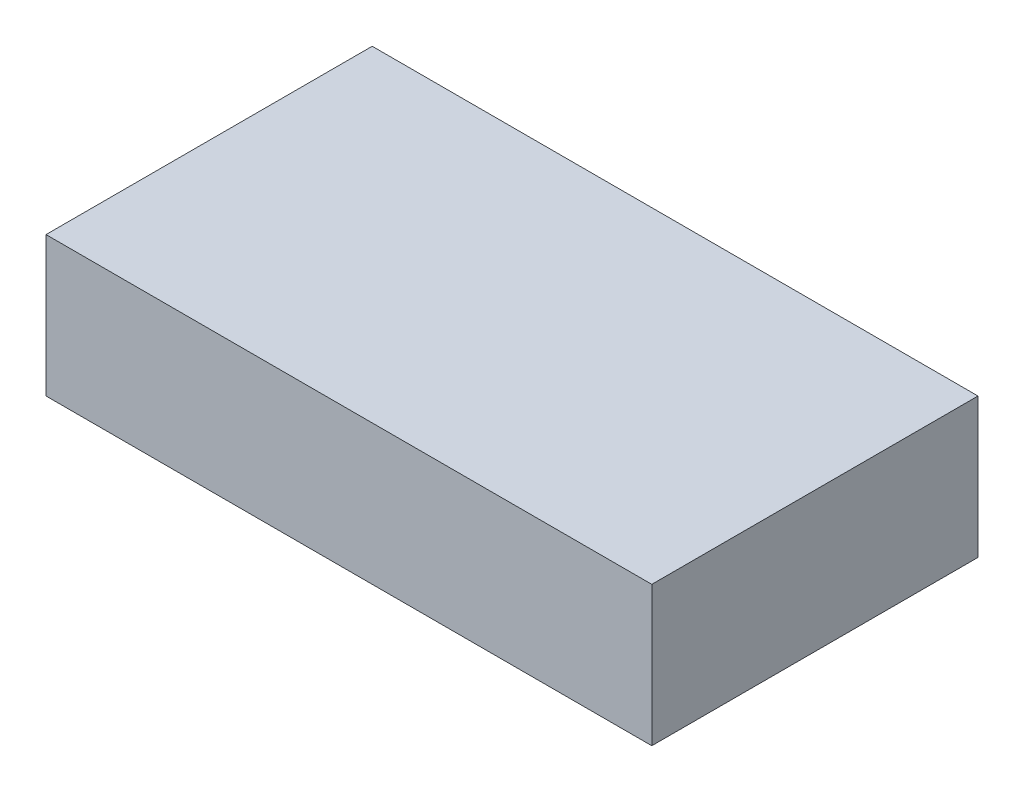
ISO-10303-21;
HEADER;
FILE_DESCRIPTION(('STEP AP214'),'2;1');
FILE_NAME('part.step','',(''),(''),'','','');
FILE_SCHEMA(('AUTOMOTIVE_DESIGN { 1 0 10303 214 1 1 1 1 }'));
ENDSEC;
DATA;
#1=APPLICATION_CONTEXT('core data for automotive mechanical design processes');
#2=APPLICATION_PROTOCOL_DEFINITION('international standard','automotive_design',2000,#1);
#3=PRODUCT_CONTEXT('',#1,'mechanical');
#4=PRODUCT('Part','Part','',(#3));
#5=PRODUCT_RELATED_PRODUCT_CATEGORY('part','',(#4));
#6=PRODUCT_DEFINITION_FORMATION('','',#4);
#7=PRODUCT_DEFINITION_CONTEXT('part definition',#1,'design');
#8=PRODUCT_DEFINITION('design','',#6,#7);
#9=PRODUCT_DEFINITION_SHAPE('','',#8);
#10=(LENGTH_UNIT() NAMED_UNIT(*) SI_UNIT(.MILLI.,.METRE.));
#11=(NAMED_UNIT(*) PLANE_ANGLE_UNIT() SI_UNIT($,.RADIAN.));
#12=(NAMED_UNIT(*) SI_UNIT($,.STERADIAN.) SOLID_ANGLE_UNIT());
#13=UNCERTAINTY_MEASURE_WITH_UNIT(LENGTH_MEASURE(1.E-05),#10,'distance_accuracy_value','');
#14=(GEOMETRIC_REPRESENTATION_CONTEXT(3) GLOBAL_UNCERTAINTY_ASSIGNED_CONTEXT((#13)) GLOBAL_UNIT_ASSIGNED_CONTEXT((#10,
#11,#12)) REPRESENTATION_CONTEXT('',''));
#15=CARTESIAN_POINT('',(0.,0.,0.));
#16=DIRECTION('',(0.,0.,1.));
#17=DIRECTION('',(1.,0.,0.));
#18=AXIS2_PLACEMENT_3D('',#15,#16,#17);
#19=CARTESIAN_POINT('',(0.,38.1,0.));
#20=DIRECTION('',(1.,0.,0.));
#21=DIRECTION('',(0.,0.,-1.));
#22=AXIS2_PLACEMENT_3D('',#19,#20,#21);
#23=PLANE('',#22);
#24=DIRECTION('',(0.,0.,1.));
#25=VECTOR('',#24,1.);
#26=CARTESIAN_POINT('',(0.,0.,0.));
#27=LINE('',#26,#25);
#28=CARTESIAN_POINT('',(0.,0.,0.));
#29=VERTEX_POINT('',#28);
#30=CARTESIAN_POINT('',(0.,0.,88.9));
#31=VERTEX_POINT('',#30);
#32=EDGE_CURVE('E96',#29,#31,#27,.T.);
#33=ORIENTED_EDGE('',*,*,#32,.T.);
#34=DIRECTION('',(0.,-1.,0.));
#35=VECTOR('',#34,1.);
#36=CARTESIAN_POINT('',(0.,38.1,88.9));
#37=LINE('',#36,#35);
#38=CARTESIAN_POINT('',(0.,38.1,88.9));
#39=VERTEX_POINT('',#38);
#40=EDGE_CURVE('E11',#39,#31,#37,.T.);
#41=ORIENTED_EDGE('',*,*,#40,.F.);
#42=DIRECTION('',(0.,0.,1.));
#43=VECTOR('',#42,1.);
#44=CARTESIAN_POINT('',(0.,38.1,0.));
#45=LINE('',#44,#43);
#46=CARTESIAN_POINT('',(0.,38.1,0.));
#47=VERTEX_POINT('',#46);
#48=EDGE_CURVE('E84',#47,#39,#45,.T.);
#49=ORIENTED_EDGE('',*,*,#48,.F.);
#50=DIRECTION('',(0.,-1.,0.));
#51=VECTOR('',#50,1.);
#52=CARTESIAN_POINT('',(0.,38.1,0.));
#53=LINE('',#52,#51);
#54=EDGE_CURVE('E92',#47,#29,#53,.T.);
#55=ORIENTED_EDGE('',*,*,#54,.T.);
#56=EDGE_LOOP('',(#33,#41,#49,#55));
#57=FACE_BOUND('',#56,.T.);
#58=ADVANCED_FACE('F33',(#57),#23,.F.);
#59=CARTESIAN_POINT('',(0.,38.1,88.9));
#60=DIRECTION('',(0.,0.,-1.));
#61=DIRECTION('',(-1.,0.,0.));
#62=AXIS2_PLACEMENT_3D('',#59,#60,#61);
#63=PLANE('',#62);
#64=DIRECTION('',(1.,0.,0.));
#65=VECTOR('',#64,1.);
#66=CARTESIAN_POINT('',(0.,0.,88.9));
#67=LINE('',#66,#65);
#68=CARTESIAN_POINT('',(165.1,0.,88.9));
#69=VERTEX_POINT('',#68);
#70=EDGE_CURVE('E88',#31,#69,#67,.T.);
#71=ORIENTED_EDGE('',*,*,#70,.T.);
#72=DIRECTION('',(0.,-1.,0.));
#73=VECTOR('',#72,1.);
#74=CARTESIAN_POINT('',(165.1,38.1,88.9));
#75=LINE('',#74,#73);
#76=CARTESIAN_POINT('',(165.1,38.1,88.9));
#77=VERTEX_POINT('',#76);
#78=EDGE_CURVE('E41',#77,#69,#75,.T.);
#79=ORIENTED_EDGE('',*,*,#78,.F.);
#80=DIRECTION('',(1.,0.,0.));
#81=VECTOR('',#80,1.);
#82=CARTESIAN_POINT('',(0.,38.1,88.9));
#83=LINE('',#82,#81);
#84=EDGE_CURVE('E79',#39,#77,#83,.T.);
#85=ORIENTED_EDGE('',*,*,#84,.F.);
#86=ORIENTED_EDGE('',*,*,#40,.T.);
#87=EDGE_LOOP('',(#71,#79,#85,#86));
#88=FACE_BOUND('',#87,.T.);
#89=ADVANCED_FACE('F87',(#88),#63,.F.);
#90=CARTESIAN_POINT('',(165.1,38.1,0.));
#91=DIRECTION('',(-1.,0.,0.));
#92=DIRECTION('',(0.,0.,1.));
#93=AXIS2_PLACEMENT_3D('',#90,#91,#92);
#94=PLANE('',#93);
#95=DIRECTION('',(0.,0.,-1.));
#96=VECTOR('',#95,1.);
#97=CARTESIAN_POINT('',(165.1,0.,0.));
#98=LINE('',#97,#96);
#99=CARTESIAN_POINT('',(165.1,0.,0.));
#100=VERTEX_POINT('',#99);
#101=EDGE_CURVE('E66',#69,#100,#98,.T.);
#102=ORIENTED_EDGE('',*,*,#101,.T.);
#103=DIRECTION('',(0.,-1.,0.));
#104=VECTOR('',#103,1.);
#105=CARTESIAN_POINT('',(165.1,38.1,0.));
#106=LINE('',#105,#104);
#107=CARTESIAN_POINT('',(165.1,38.1,0.));
#108=VERTEX_POINT('',#107);
#109=EDGE_CURVE('E89',#108,#100,#106,.T.);
#110=ORIENTED_EDGE('',*,*,#109,.F.);
#111=DIRECTION('',(0.,0.,-1.));
#112=VECTOR('',#111,1.);
#113=CARTESIAN_POINT('',(165.1,38.1,0.));
#114=LINE('',#113,#112);
#115=EDGE_CURVE('E82',#77,#108,#114,.T.);
#116=ORIENTED_EDGE('',*,*,#115,.F.);
#117=ORIENTED_EDGE('',*,*,#78,.T.);
#118=EDGE_LOOP('',(#102,#110,#116,#117));
#119=FACE_BOUND('',#118,.T.);
#120=ADVANCED_FACE('F90',(#119),#94,.F.);
#121=CARTESIAN_POINT('',(0.,38.1,0.));
#122=DIRECTION('',(0.,0.,1.));
#123=DIRECTION('',(1.,0.,0.));
#124=AXIS2_PLACEMENT_3D('',#121,#122,#123);
#125=PLANE('',#124);
#126=DIRECTION('',(-1.,0.,0.));
#127=VECTOR('',#126,1.);
#128=CARTESIAN_POINT('',(0.,0.,0.));
#129=LINE('',#128,#127);
#130=EDGE_CURVE('E72',#100,#29,#129,.T.);
#131=ORIENTED_EDGE('',*,*,#130,.T.);
#132=ORIENTED_EDGE('',*,*,#54,.F.);
#133=DIRECTION('',(-1.,0.,0.));
#134=VECTOR('',#133,1.);
#135=CARTESIAN_POINT('',(0.,38.1,0.));
#136=LINE('',#135,#134);
#137=EDGE_CURVE('E49',#108,#47,#136,.T.);
#138=ORIENTED_EDGE('',*,*,#137,.F.);
#139=ORIENTED_EDGE('',*,*,#109,.T.);
#140=EDGE_LOOP('',(#131,#132,#138,#139));
#141=FACE_BOUND('',#140,.T.);
#142=ADVANCED_FACE('F103',(#141),#125,.F.);
#143=CARTESIAN_POINT('',(0.,38.1,0.));
#144=DIRECTION('',(0.,1.,0.));
#145=DIRECTION('',(0.,0.,1.));
#146=AXIS2_PLACEMENT_3D('',#143,#144,#145);
#147=PLANE('',#146);
#148=ORIENTED_EDGE('',*,*,#48,.T.);
#149=ORIENTED_EDGE('',*,*,#84,.T.);
#150=ORIENTED_EDGE('',*,*,#115,.T.);
#151=ORIENTED_EDGE('',*,*,#137,.T.);
#152=EDGE_LOOP('',(#148,#149,#150,#151));
#153=FACE_BOUND('',#152,.T.);
#154=ADVANCED_FACE('F80',(#153),#147,.T.);
#155=CARTESIAN_POINT('',(0.,0.,0.));
#156=DIRECTION('',(0.,1.,0.));
#157=DIRECTION('',(0.,0.,1.));
#158=AXIS2_PLACEMENT_3D('',#155,#156,#157);
#159=PLANE('',#158);
#160=ORIENTED_EDGE('',*,*,#32,.F.);
#161=ORIENTED_EDGE('',*,*,#130,.F.);
#162=ORIENTED_EDGE('',*,*,#101,.F.);
#163=ORIENTED_EDGE('',*,*,#70,.F.);
#164=EDGE_LOOP('',(#160,#161,#162,#163));
#165=FACE_BOUND('',#164,.T.);
#166=ADVANCED_FACE('F106',(#165),#159,.F.);
#167=CLOSED_SHELL('',(#58,#89,#120,#142,#154,#166));
#168=MANIFOLD_SOLID_BREP('B2',#167);
#169=ADVANCED_BREP_SHAPE_REPRESENTATION('',(#18,#168),#14);
#170=SHAPE_DEFINITION_REPRESENTATION(#9,#169);
ENDSEC;
END-ISO-10303-21;
